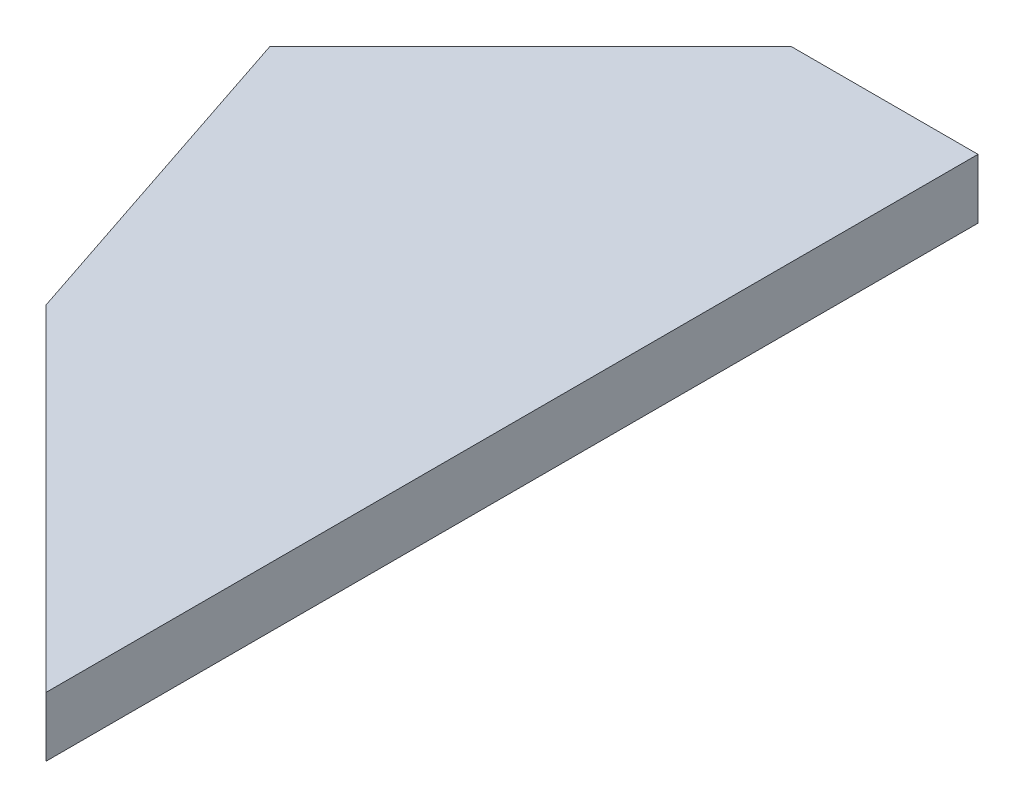
ISO-10303-21;
HEADER;
FILE_DESCRIPTION(('STEP AP214'),'2;1');
FILE_NAME('part.step','',(''),(''),'','','');
FILE_SCHEMA(('AUTOMOTIVE_DESIGN { 1 0 10303 214 1 1 1 1 }'));
ENDSEC;
DATA;
#1=APPLICATION_CONTEXT('core data for automotive mechanical design processes');
#2=APPLICATION_PROTOCOL_DEFINITION('international standard','automotive_design',2000,#1);
#3=PRODUCT_CONTEXT('',#1,'mechanical');
#4=PRODUCT('Part','Part','',(#3));
#5=PRODUCT_RELATED_PRODUCT_CATEGORY('part','',(#4));
#6=PRODUCT_DEFINITION_FORMATION('','',#4);
#7=PRODUCT_DEFINITION_CONTEXT('part definition',#1,'design');
#8=PRODUCT_DEFINITION('design','',#6,#7);
#9=PRODUCT_DEFINITION_SHAPE('','',#8);
#10=(LENGTH_UNIT() NAMED_UNIT(*) SI_UNIT(.MILLI.,.METRE.));
#11=(NAMED_UNIT(*) PLANE_ANGLE_UNIT() SI_UNIT($,.RADIAN.));
#12=(NAMED_UNIT(*) SI_UNIT($,.STERADIAN.) SOLID_ANGLE_UNIT());
#13=UNCERTAINTY_MEASURE_WITH_UNIT(LENGTH_MEASURE(1.E-05),#10,'distance_accuracy_value','');
#14=(GEOMETRIC_REPRESENTATION_CONTEXT(3) GLOBAL_UNCERTAINTY_ASSIGNED_CONTEXT((#13)) GLOBAL_UNIT_ASSIGNED_CONTEXT((#10,
#11,#12)) REPRESENTATION_CONTEXT('',''));
#15=CARTESIAN_POINT('',(0.,0.,0.));
#16=DIRECTION('',(0.,0.,1.));
#17=DIRECTION('',(1.,0.,0.));
#18=AXIS2_PLACEMENT_3D('',#15,#16,#17);
#19=CARTESIAN_POINT('',(68.4000000000001,6.4,-22.8000000000003));
#20=DIRECTION('',(-0.948683298050513,0.,0.316227766016841));
#21=DIRECTION('',(0.316227766016841,0.,0.948683298050513));
#22=AXIS2_PLACEMENT_3D('',#19,#20,#21);
#23=PLANE('',#22);
#24=DIRECTION('',(-0.316227766016841,0.,-0.948683298050513));
#25=VECTOR('',#24,1.);
#26=CARTESIAN_POINT('',(68.4000000000001,0.,-22.8000000000003));
#27=LINE('',#26,#25);
#28=CARTESIAN_POINT('',(64.0000000000001,0.,-36.));
#29=VERTEX_POINT('',#28);
#30=CARTESIAN_POINT('',(52.,0.,-72.));
#31=VERTEX_POINT('',#30);
#32=EDGE_CURVE('E109',#29,#31,#27,.T.);
#33=ORIENTED_EDGE('',*,*,#32,.F.);
#34=DIRECTION('',(0.,-1.,0.));
#35=VECTOR('',#34,1.);
#36=CARTESIAN_POINT('',(64.0000000000001,6.4,-36.));
#37=LINE('',#36,#35);
#38=CARTESIAN_POINT('',(64.0000000000001,6.4,-36.));
#39=VERTEX_POINT('',#38);
#40=EDGE_CURVE('E11',#39,#29,#37,.T.);
#41=ORIENTED_EDGE('',*,*,#40,.F.);
#42=DIRECTION('',(-0.316227766016841,0.,-0.948683298050513));
#43=VECTOR('',#42,1.);
#44=CARTESIAN_POINT('',(68.4000000000001,6.4,-22.8000000000003));
#45=LINE('',#44,#43);
#46=CARTESIAN_POINT('',(52.,6.4,-72.));
#47=VERTEX_POINT('',#46);
#48=EDGE_CURVE('E119',#39,#47,#45,.T.);
#49=ORIENTED_EDGE('',*,*,#48,.T.);
#50=DIRECTION('',(0.,-1.,0.));
#51=VECTOR('',#50,1.);
#52=CARTESIAN_POINT('',(52.,6.4,-72.));
#53=LINE('',#52,#51);
#54=EDGE_CURVE('E51',#47,#31,#53,.T.);
#55=ORIENTED_EDGE('',*,*,#54,.T.);
#56=EDGE_LOOP('',(#33,#41,#49,#55));
#57=FACE_BOUND('',#56,.T.);
#58=ADVANCED_FACE('F35',(#57),#23,.T.);
#59=CARTESIAN_POINT('',(50.0000000000002,6.4,-50.));
#60=DIRECTION('',(0.707106781186549,0.,-0.707106781186546));
#61=DIRECTION('',(-0.707106781186546,0.,-0.707106781186549));
#62=AXIS2_PLACEMENT_3D('',#59,#60,#61);
#63=PLANE('',#62);
#64=DIRECTION('',(0.707106781186546,0.,0.707106781186549));
#65=VECTOR('',#64,1.);
#66=CARTESIAN_POINT('',(50.0000000000002,0.,-50.));
#67=LINE('',#66,#65);
#68=CARTESIAN_POINT('',(100.,0.,0.));
#69=VERTEX_POINT('',#68);
#70=EDGE_CURVE('E111',#29,#69,#67,.T.);
#71=ORIENTED_EDGE('',*,*,#70,.T.);
#72=DIRECTION('',(0.,-1.,0.));
#73=VECTOR('',#72,1.);
#74=CARTESIAN_POINT('',(100.,6.4,0.));
#75=LINE('',#74,#73);
#76=CARTESIAN_POINT('',(100.,6.4,0.));
#77=VERTEX_POINT('',#76);
#78=EDGE_CURVE('E43',#77,#69,#75,.T.);
#79=ORIENTED_EDGE('',*,*,#78,.F.);
#80=DIRECTION('',(0.707106781186546,0.,0.707106781186549));
#81=VECTOR('',#80,1.);
#82=CARTESIAN_POINT('',(50.0000000000002,6.4,-50.));
#83=LINE('',#82,#81);
#84=EDGE_CURVE('E90',#39,#77,#83,.T.);
#85=ORIENTED_EDGE('',*,*,#84,.F.);
#86=ORIENTED_EDGE('',*,*,#40,.T.);
#87=EDGE_LOOP('',(#71,#79,#85,#86));
#88=FACE_BOUND('',#87,.T.);
#89=ADVANCED_FACE('F136',(#88),#63,.F.);
#90=CARTESIAN_POINT('',(100.,6.4,0.));
#91=DIRECTION('',(-1.,0.,0.));
#92=DIRECTION('',(0.,0.,1.));
#93=AXIS2_PLACEMENT_3D('',#90,#91,#92);
#94=PLANE('',#93);
#95=DIRECTION('',(0.,0.,-1.));
#96=VECTOR('',#95,1.);
#97=CARTESIAN_POINT('',(100.,0.,0.));
#98=LINE('',#97,#96);
#99=CARTESIAN_POINT('',(100.,0.,-100.));
#100=VERTEX_POINT('',#99);
#101=EDGE_CURVE('E99',#69,#100,#98,.T.);
#102=ORIENTED_EDGE('',*,*,#101,.T.);
#103=DIRECTION('',(0.,-1.,0.));
#104=VECTOR('',#103,1.);
#105=CARTESIAN_POINT('',(100.,6.4,-100.));
#106=LINE('',#105,#104);
#107=CARTESIAN_POINT('',(100.,6.4,-100.));
#108=VERTEX_POINT('',#107);
#109=EDGE_CURVE('E96',#108,#100,#106,.T.);
#110=ORIENTED_EDGE('',*,*,#109,.F.);
#111=DIRECTION('',(0.,0.,-1.));
#112=VECTOR('',#111,1.);
#113=CARTESIAN_POINT('',(100.,6.4,0.));
#114=LINE('',#113,#112);
#115=EDGE_CURVE('E83',#77,#108,#114,.T.);
#116=ORIENTED_EDGE('',*,*,#115,.F.);
#117=ORIENTED_EDGE('',*,*,#78,.T.);
#118=EDGE_LOOP('',(#102,#110,#116,#117));
#119=FACE_BOUND('',#118,.T.);
#120=ADVANCED_FACE('F97',(#119),#94,.F.);
#121=CARTESIAN_POINT('',(0.,6.4,-100.));
#122=DIRECTION('',(0.,0.,-1.));
#123=DIRECTION('',(-1.,0.,0.));
#124=AXIS2_PLACEMENT_3D('',#121,#122,#123);
#125=PLANE('',#124);
#126=DIRECTION('',(1.,0.,0.));
#127=VECTOR('',#126,1.);
#128=CARTESIAN_POINT('',(0.,0.,-100.));
#129=LINE('',#128,#127);
#130=CARTESIAN_POINT('',(80.,0.,-100.));
#131=VERTEX_POINT('',#130);
#132=EDGE_CURVE('E114',#131,#100,#129,.T.);
#133=ORIENTED_EDGE('',*,*,#132,.F.);
#134=DIRECTION('',(0.,-1.,0.));
#135=VECTOR('',#134,1.);
#136=CARTESIAN_POINT('',(80.,6.4,-100.));
#137=LINE('',#136,#135);
#138=CARTESIAN_POINT('',(80.,6.4,-100.));
#139=VERTEX_POINT('',#138);
#140=EDGE_CURVE('E67',#139,#131,#137,.T.);
#141=ORIENTED_EDGE('',*,*,#140,.F.);
#142=DIRECTION('',(1.,0.,0.));
#143=VECTOR('',#142,1.);
#144=CARTESIAN_POINT('',(0.,6.4,-100.));
#145=LINE('',#144,#143);
#146=EDGE_CURVE('E89',#139,#108,#145,.T.);
#147=ORIENTED_EDGE('',*,*,#146,.T.);
#148=ORIENTED_EDGE('',*,*,#109,.T.);
#149=EDGE_LOOP('',(#133,#141,#147,#148));
#150=FACE_BOUND('',#149,.T.);
#151=ADVANCED_FACE('F103',(#150),#125,.T.);
#152=CARTESIAN_POINT('',(-10.,6.4,-10.));
#153=DIRECTION('',(-0.707106781186548,0.,-0.707106781186548));
#154=DIRECTION('',(-0.707106781186548,0.,0.707106781186548));
#155=AXIS2_PLACEMENT_3D('',#152,#153,#154);
#156=PLANE('',#155);
#157=DIRECTION('',(0.707106781186548,0.,-0.707106781186548));
#158=VECTOR('',#157,1.);
#159=CARTESIAN_POINT('',(-10.,0.,-10.));
#160=LINE('',#159,#158);
#161=EDGE_CURVE('E116',#31,#131,#160,.T.);
#162=ORIENTED_EDGE('',*,*,#161,.F.);
#163=ORIENTED_EDGE('',*,*,#54,.F.);
#164=DIRECTION('',(0.707106781186548,0.,-0.707106781186548));
#165=VECTOR('',#164,1.);
#166=CARTESIAN_POINT('',(-10.,6.4,-10.));
#167=LINE('',#166,#165);
#168=EDGE_CURVE('E104',#47,#139,#167,.T.);
#169=ORIENTED_EDGE('',*,*,#168,.T.);
#170=ORIENTED_EDGE('',*,*,#140,.T.);
#171=EDGE_LOOP('',(#162,#163,#169,#170));
#172=FACE_BOUND('',#171,.T.);
#173=ADVANCED_FACE('F125',(#172),#156,.T.);
#174=CARTESIAN_POINT('',(0.,6.4,0.));
#175=DIRECTION('',(0.,1.,0.));
#176=DIRECTION('',(0.,0.,1.));
#177=AXIS2_PLACEMENT_3D('',#174,#175,#176);
#178=PLANE('',#177);
#179=ORIENTED_EDGE('',*,*,#48,.F.);
#180=ORIENTED_EDGE('',*,*,#84,.T.);
#181=ORIENTED_EDGE('',*,*,#115,.T.);
#182=ORIENTED_EDGE('',*,*,#146,.F.);
#183=ORIENTED_EDGE('',*,*,#168,.F.);
#184=EDGE_LOOP('',(#179,#180,#181,#182,#183));
#185=FACE_BOUND('',#184,.T.);
#186=ADVANCED_FACE('F86',(#185),#178,.T.);
#187=CARTESIAN_POINT('',(0.,0.,0.));
#188=DIRECTION('',(0.,1.,0.));
#189=DIRECTION('',(0.,0.,1.));
#190=AXIS2_PLACEMENT_3D('',#187,#188,#189);
#191=PLANE('',#190);
#192=ORIENTED_EDGE('',*,*,#32,.T.);
#193=ORIENTED_EDGE('',*,*,#161,.T.);
#194=ORIENTED_EDGE('',*,*,#132,.T.);
#195=ORIENTED_EDGE('',*,*,#101,.F.);
#196=ORIENTED_EDGE('',*,*,#70,.F.);
#197=EDGE_LOOP('',(#192,#193,#194,#195,#196));
#198=FACE_BOUND('',#197,.T.);
#199=ADVANCED_FACE('F124',(#198),#191,.F.);
#200=CLOSED_SHELL('',(#58,#89,#120,#151,#173,#186,#199));
#201=MANIFOLD_SOLID_BREP('B2',#200);
#202=ADVANCED_BREP_SHAPE_REPRESENTATION('',(#18,#201),#14);
#203=SHAPE_DEFINITION_REPRESENTATION(#9,#202);
ENDSEC;
END-ISO-10303-21;
